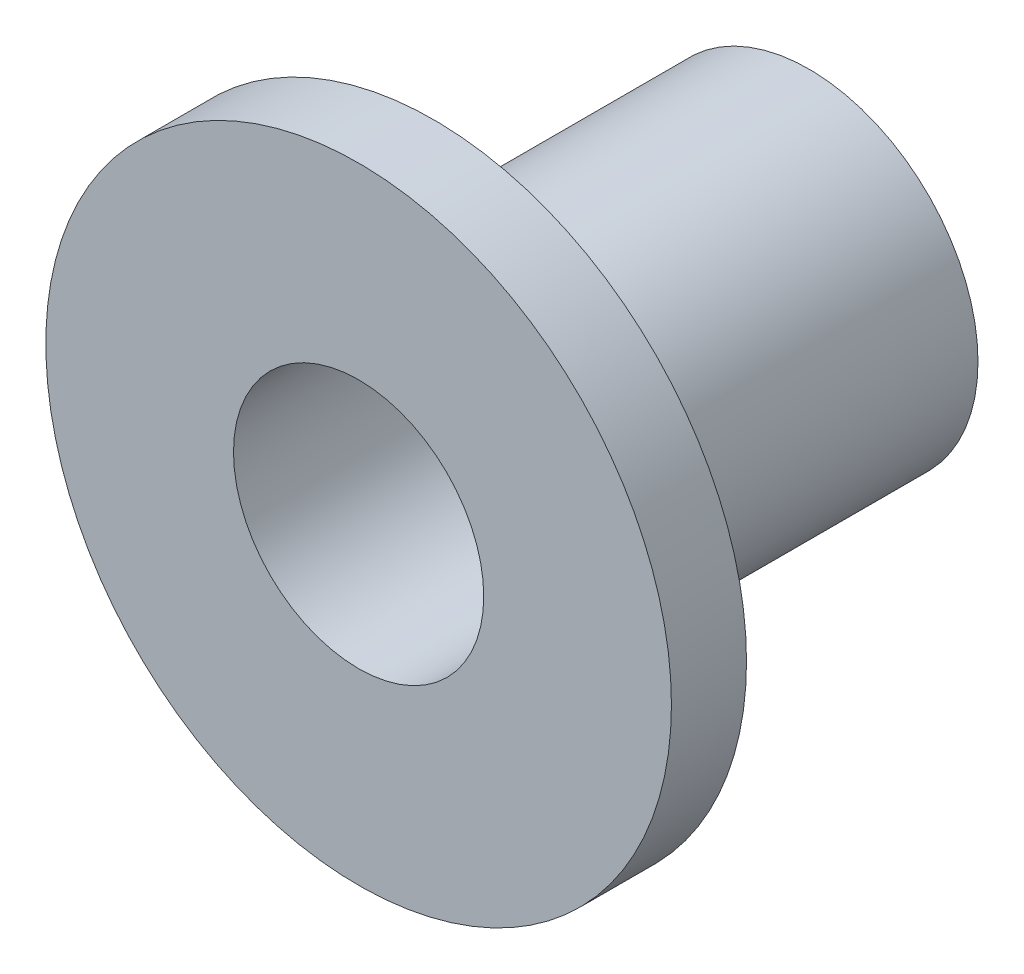
ISO-10303-21;
HEADER;
FILE_DESCRIPTION(('STEP AP214'),'2;1');
FILE_NAME('part.step','',(''),(''),'','','');
FILE_SCHEMA(('AUTOMOTIVE_DESIGN { 1 0 10303 214 1 1 1 1 }'));
ENDSEC;
DATA;
#1=APPLICATION_CONTEXT('core data for automotive mechanical design processes');
#2=APPLICATION_PROTOCOL_DEFINITION('international standard','automotive_design',2000,#1);
#3=PRODUCT_CONTEXT('',#1,'mechanical');
#4=PRODUCT('Part','Part','',(#3));
#5=PRODUCT_RELATED_PRODUCT_CATEGORY('part','',(#4));
#6=PRODUCT_DEFINITION_FORMATION('','',#4);
#7=PRODUCT_DEFINITION_CONTEXT('part definition',#1,'design');
#8=PRODUCT_DEFINITION('design','',#6,#7);
#9=PRODUCT_DEFINITION_SHAPE('','',#8);
#10=(LENGTH_UNIT() NAMED_UNIT(*) SI_UNIT(.MILLI.,.METRE.));
#11=(NAMED_UNIT(*) PLANE_ANGLE_UNIT() SI_UNIT($,.RADIAN.));
#12=(NAMED_UNIT(*) SI_UNIT($,.STERADIAN.) SOLID_ANGLE_UNIT());
#13=UNCERTAINTY_MEASURE_WITH_UNIT(LENGTH_MEASURE(1.E-05),#10,'distance_accuracy_value','');
#14=(GEOMETRIC_REPRESENTATION_CONTEXT(3) GLOBAL_UNCERTAINTY_ASSIGNED_CONTEXT((#13)) GLOBAL_UNIT_ASSIGNED_CONTEXT((#10,
#11,#12)) REPRESENTATION_CONTEXT('',''));
#15=CARTESIAN_POINT('',(0.,0.,0.));
#16=DIRECTION('',(0.,0.,1.));
#17=DIRECTION('',(1.,0.,0.));
#18=AXIS2_PLACEMENT_3D('',#15,#16,#17);
#19=CARTESIAN_POINT('',(0.,0.,-0.9));
#20=DIRECTION('',(0.,0.,1.));
#21=DIRECTION('',(1.,0.,0.));
#22=AXIS2_PLACEMENT_3D('',#19,#20,#21);
#23=CYLINDRICAL_SURFACE('',#22,0.3375);
#24=CARTESIAN_POINT('',(0.,0.,-0.9));
#25=DIRECTION('',(0.,0.,1.));
#26=DIRECTION('',(1.,0.,0.));
#27=AXIS2_PLACEMENT_3D('',#24,#25,#26);
#28=CIRCLE('',#27,0.3375);
#29=CARTESIAN_POINT('',(0.3375,0.,-0.9));
#30=VERTEX_POINT('',#29);
#31=EDGE_CURVE('E10',#30,#30,#28,.T.);
#32=ORIENTED_EDGE('',*,*,#31,.T.);
#33=EDGE_LOOP('',(#32));
#34=FACE_BOUND('',#33,.T.);
#35=CARTESIAN_POINT('',(0.,0.,-0.15));
#36=DIRECTION('',(0.,0.,1.));
#37=DIRECTION('',(1.,0.,0.));
#38=AXIS2_PLACEMENT_3D('',#35,#36,#37);
#39=CIRCLE('',#38,0.3375);
#40=CARTESIAN_POINT('',(0.3375,0.,-0.15));
#41=VERTEX_POINT('',#40);
#42=EDGE_CURVE('E34',#41,#41,#39,.F.);
#43=ORIENTED_EDGE('',*,*,#42,.T.);
#44=EDGE_LOOP('',(#43));
#45=FACE_BOUND('',#44,.T.);
#46=ADVANCED_FACE('F31',(#34,#45),#23,.T.);
#47=CARTESIAN_POINT('',(0.,0.,-0.9));
#48=DIRECTION('',(0.,0.,1.));
#49=DIRECTION('',(1.,0.,0.));
#50=AXIS2_PLACEMENT_3D('',#47,#48,#49);
#51=PLANE('',#50);
#52=CARTESIAN_POINT('',(0.,0.,-0.9));
#53=DIRECTION('',(0.,0.,1.));
#54=DIRECTION('',(1.,0.,0.));
#55=AXIS2_PLACEMENT_3D('',#52,#53,#54);
#56=CIRCLE('',#55,0.25);
#57=CARTESIAN_POINT('',(0.25,0.,-0.9));
#58=VERTEX_POINT('',#57);
#59=EDGE_CURVE('E46',#58,#58,#56,.T.);
#60=ORIENTED_EDGE('',*,*,#59,.T.);
#61=EDGE_LOOP('',(#60));
#62=FACE_BOUND('',#61,.T.);
#63=ORIENTED_EDGE('',*,*,#31,.F.);
#64=EDGE_LOOP('',(#63));
#65=FACE_BOUND('',#64,.T.);
#66=ADVANCED_FACE('F55',(#62,#65),#51,.F.);
#67=CARTESIAN_POINT('',(0.,0.,-0.15));
#68=DIRECTION('',(0.,0.,1.));
#69=DIRECTION('',(1.,0.,0.));
#70=AXIS2_PLACEMENT_3D('',#67,#68,#69);
#71=CYLINDRICAL_SURFACE('',#70,0.625);
#72=CARTESIAN_POINT('',(0.,0.,-0.15));
#73=DIRECTION('',(0.,0.,1.));
#74=DIRECTION('',(1.,0.,0.));
#75=AXIS2_PLACEMENT_3D('',#72,#73,#74);
#76=CIRCLE('',#75,0.625);
#77=CARTESIAN_POINT('',(0.625,0.,-0.15));
#78=VERTEX_POINT('',#77);
#79=EDGE_CURVE('E41',#78,#78,#76,.T.);
#80=ORIENTED_EDGE('',*,*,#79,.T.);
#81=EDGE_LOOP('',(#80));
#82=FACE_BOUND('',#81,.T.);
#83=CARTESIAN_POINT('',(0.,0.,0.));
#84=DIRECTION('',(0.,0.,1.));
#85=DIRECTION('',(1.,0.,0.));
#86=AXIS2_PLACEMENT_3D('',#83,#84,#85);
#87=CIRCLE('',#86,0.625);
#88=CARTESIAN_POINT('',(0.625,0.,0.));
#89=VERTEX_POINT('',#88);
#90=EDGE_CURVE('E43',#89,#89,#87,.T.);
#91=ORIENTED_EDGE('',*,*,#90,.F.);
#92=EDGE_LOOP('',(#91));
#93=FACE_BOUND('',#92,.T.);
#94=ADVANCED_FACE('F70',(#82,#93),#71,.T.);
#95=CARTESIAN_POINT('',(0.,0.,-0.15));
#96=DIRECTION('',(0.,0.,1.));
#97=DIRECTION('',(1.,0.,0.));
#98=AXIS2_PLACEMENT_3D('',#95,#96,#97);
#99=PLANE('',#98);
#100=ORIENTED_EDGE('',*,*,#42,.F.);
#101=EDGE_LOOP('',(#100));
#102=FACE_BOUND('',#101,.T.);
#103=ORIENTED_EDGE('',*,*,#79,.F.);
#104=EDGE_LOOP('',(#103));
#105=FACE_BOUND('',#104,.T.);
#106=ADVANCED_FACE('F67',(#102,#105),#99,.F.);
#107=CARTESIAN_POINT('',(0.,0.,0.));
#108=DIRECTION('',(0.,0.,1.));
#109=DIRECTION('',(1.,0.,0.));
#110=AXIS2_PLACEMENT_3D('',#107,#108,#109);
#111=PLANE('',#110);
#112=CARTESIAN_POINT('',(0.,0.,0.));
#113=DIRECTION('',(0.,0.,1.));
#114=DIRECTION('',(1.,0.,0.));
#115=AXIS2_PLACEMENT_3D('',#112,#113,#114);
#116=CIRCLE('',#115,0.25);
#117=CARTESIAN_POINT('',(0.25,0.,0.));
#118=VERTEX_POINT('',#117);
#119=EDGE_CURVE('E49',#118,#118,#116,.T.);
#120=ORIENTED_EDGE('',*,*,#119,.F.);
#121=EDGE_LOOP('',(#120));
#122=FACE_BOUND('',#121,.T.);
#123=ORIENTED_EDGE('',*,*,#90,.T.);
#124=EDGE_LOOP('',(#123));
#125=FACE_BOUND('',#124,.T.);
#126=ADVANCED_FACE('F61',(#122,#125),#111,.T.);
#127=CARTESIAN_POINT('',(0.,0.,-0.9));
#128=DIRECTION('',(0.,0.,1.));
#129=DIRECTION('',(1.,0.,0.));
#130=AXIS2_PLACEMENT_3D('',#127,#128,#129);
#131=CYLINDRICAL_SURFACE('',#130,0.25);
#132=ORIENTED_EDGE('',*,*,#59,.F.);
#133=EDGE_LOOP('',(#132));
#134=FACE_BOUND('',#133,.T.);
#135=ORIENTED_EDGE('',*,*,#119,.T.);
#136=EDGE_LOOP('',(#135));
#137=FACE_BOUND('',#136,.T.);
#138=ADVANCED_FACE('F58',(#134,#137),#131,.F.);
#139=CLOSED_SHELL('',(#46,#66,#94,#106,#126,#138));
#140=MANIFOLD_SOLID_BREP('B2',#139);
#141=ADVANCED_BREP_SHAPE_REPRESENTATION('',(#18,#140),#14);
#142=SHAPE_DEFINITION_REPRESENTATION(#9,#141);
ENDSEC;
END-ISO-10303-21;
